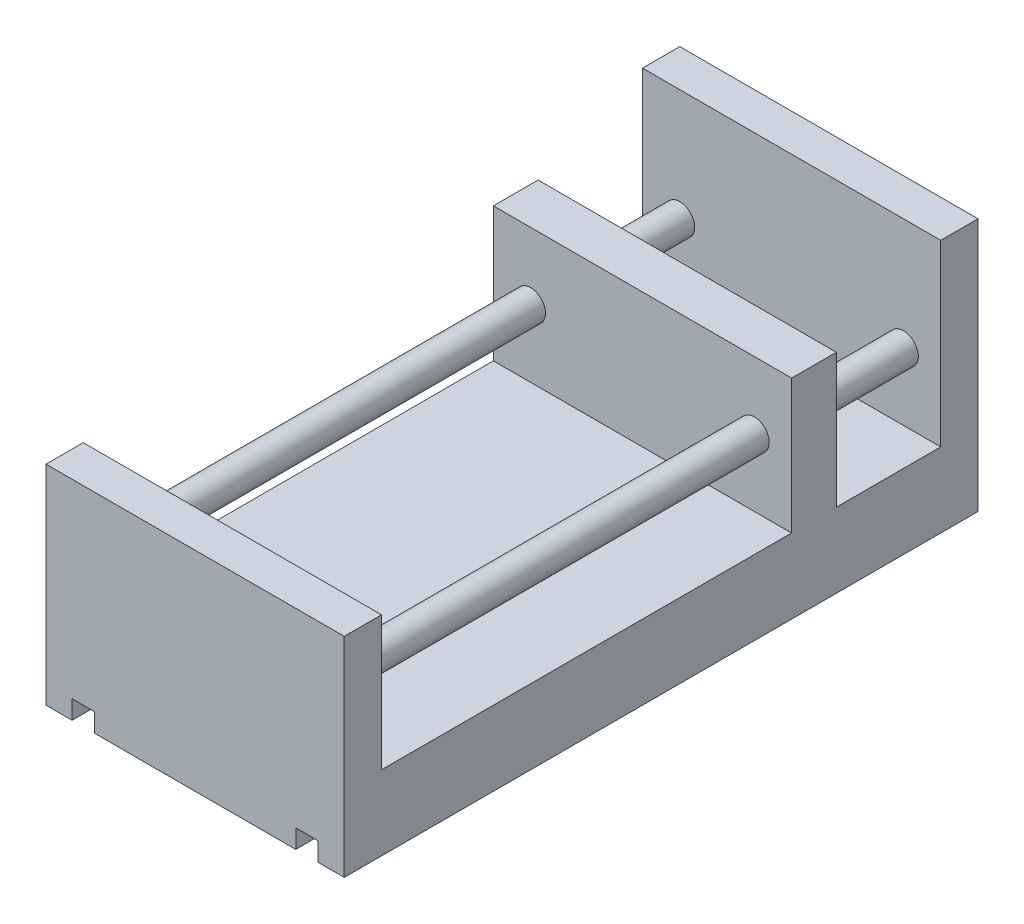
ISO-10303-21;
HEADER;
FILE_DESCRIPTION(('STEP AP214'),'2;1');
FILE_NAME('part.step','',(''),(''),'','','');
FILE_SCHEMA(('AUTOMOTIVE_DESIGN { 1 0 10303 214 1 1 1 1 }'));
ENDSEC;
DATA;
#1=APPLICATION_CONTEXT('core data for automotive mechanical design processes');
#2=APPLICATION_PROTOCOL_DEFINITION('international standard','automotive_design',2000,#1);
#3=PRODUCT_CONTEXT('',#1,'mechanical');
#4=PRODUCT('Part','Part','',(#3));
#5=PRODUCT_RELATED_PRODUCT_CATEGORY('part','',(#4));
#6=PRODUCT_DEFINITION_FORMATION('','',#4);
#7=PRODUCT_DEFINITION_CONTEXT('part definition',#1,'design');
#8=PRODUCT_DEFINITION('design','',#6,#7);
#9=PRODUCT_DEFINITION_SHAPE('','',#8);
#10=(LENGTH_UNIT() NAMED_UNIT(*) SI_UNIT(.MILLI.,.METRE.));
#11=(NAMED_UNIT(*) PLANE_ANGLE_UNIT() SI_UNIT($,.RADIAN.));
#12=(NAMED_UNIT(*) SI_UNIT($,.STERADIAN.) SOLID_ANGLE_UNIT());
#13=UNCERTAINTY_MEASURE_WITH_UNIT(LENGTH_MEASURE(1.E-05),#10,'distance_accuracy_value','');
#14=(GEOMETRIC_REPRESENTATION_CONTEXT(3) GLOBAL_UNCERTAINTY_ASSIGNED_CONTEXT((#13)) GLOBAL_UNIT_ASSIGNED_CONTEXT((#10,
#11,#12)) REPRESENTATION_CONTEXT('',''));
#15=CARTESIAN_POINT('',(0.,0.,0.));
#16=DIRECTION('',(0.,0.,1.));
#17=DIRECTION('',(1.,0.,0.));
#18=AXIS2_PLACEMENT_3D('',#15,#16,#17);
#19=CARTESIAN_POINT('',(0.,0.,0.));
#20=DIRECTION('',(0.,1.,0.));
#21=DIRECTION('',(0.,0.,1.));
#22=AXIS2_PLACEMENT_3D('',#19,#20,#21);
#23=PLANE('',#22);
#24=DIRECTION('',(1.,0.,0.));
#25=VECTOR('',#24,1.);
#26=CARTESIAN_POINT('',(0.,0.,85.));
#27=LINE('',#26,#25);
#28=CARTESIAN_POINT('',(33.,0.,85.));
#29=VERTEX_POINT('',#28);
#30=CARTESIAN_POINT('',(40.,0.,85.));
#31=VERTEX_POINT('',#30);
#32=EDGE_CURVE('E298',#29,#31,#27,.T.);
#33=ORIENTED_EDGE('',*,*,#32,.F.);
#34=DIRECTION('',(0.,0.,1.));
#35=VECTOR('',#34,1.);
#36=CARTESIAN_POINT('',(33.,0.,85.));
#37=LINE('',#36,#35);
#38=CARTESIAN_POINT('',(33.,0.,-85.));
#39=VERTEX_POINT('',#38);
#40=EDGE_CURVE('E185',#39,#29,#37,.T.);
#41=ORIENTED_EDGE('',*,*,#40,.F.);
#42=DIRECTION('',(1.,0.,0.));
#43=VECTOR('',#42,1.);
#44=CARTESIAN_POINT('',(0.,0.,-85.));
#45=LINE('',#44,#43);
#46=CARTESIAN_POINT('',(40.,0.,-85.));
#47=VERTEX_POINT('',#46);
#48=EDGE_CURVE('E232',#39,#47,#45,.T.);
#49=ORIENTED_EDGE('',*,*,#48,.T.);
#50=DIRECTION('',(0.,0.,1.));
#51=VECTOR('',#50,1.);
#52=CARTESIAN_POINT('',(40.,0.,0.));
#53=LINE('',#52,#51);
#54=EDGE_CURVE('E328',#47,#31,#53,.T.);
#55=ORIENTED_EDGE('',*,*,#54,.T.);
#56=EDGE_LOOP('',(#33,#41,#49,#55));
#57=FACE_BOUND('',#56,.T.);
#58=ADVANCED_FACE('F32',(#57),#23,.F.);
#59=CARTESIAN_POINT('',(-27.,0.,-85.));
#60=VERTEX_POINT('',#59);
#61=CARTESIAN_POINT('',(27.,0.,-85.));
#62=VERTEX_POINT('',#61);
#63=EDGE_CURVE('E252',#60,#62,#45,.T.);
#64=ORIENTED_EDGE('',*,*,#63,.T.);
#65=DIRECTION('',(0.,0.,-1.));
#66=VECTOR('',#65,1.);
#67=CARTESIAN_POINT('',(27.,0.,85.));
#68=LINE('',#67,#66);
#69=CARTESIAN_POINT('',(27.,0.,85.));
#70=VERTEX_POINT('',#69);
#71=EDGE_CURVE('E393',#70,#62,#68,.T.);
#72=ORIENTED_EDGE('',*,*,#71,.F.);
#73=CARTESIAN_POINT('',(-27.,0.,85.));
#74=VERTEX_POINT('',#73);
#75=EDGE_CURVE('E191',#74,#70,#27,.T.);
#76=ORIENTED_EDGE('',*,*,#75,.F.);
#77=DIRECTION('',(0.,0.,1.));
#78=VECTOR('',#77,1.);
#79=CARTESIAN_POINT('',(-27.,0.,85.));
#80=LINE('',#79,#78);
#81=EDGE_CURVE('E200',#60,#74,#80,.T.);
#82=ORIENTED_EDGE('',*,*,#81,.F.);
#83=EDGE_LOOP('',(#64,#72,#76,#82));
#84=FACE_BOUND('',#83,.T.);
#85=ADVANCED_FACE('F392',(#84),#23,.F.);
#86=CARTESIAN_POINT('',(-40.,20.,0.));
#87=DIRECTION('',(1.,0.,0.));
#88=DIRECTION('',(0.,0.,-1.));
#89=AXIS2_PLACEMENT_3D('',#86,#87,#88);
#90=PLANE('',#89);
#91=DIRECTION('',(0.,0.,1.));
#92=VECTOR('',#91,1.);
#93=CARTESIAN_POINT('',(-40.,0.,0.));
#94=LINE('',#93,#92);
#95=CARTESIAN_POINT('',(-40.,0.,-85.));
#96=VERTEX_POINT('',#95);
#97=CARTESIAN_POINT('',(-40.,0.,85.));
#98=VERTEX_POINT('',#97);
#99=EDGE_CURVE('E323',#96,#98,#94,.T.);
#100=ORIENTED_EDGE('',*,*,#99,.T.);
#101=DIRECTION('',(0.,-1.,0.));
#102=VECTOR('',#101,1.);
#103=CARTESIAN_POINT('',(-40.,56.,85.));
#104=LINE('',#103,#102);
#105=CARTESIAN_POINT('',(-40.,56.,85.));
#106=VERTEX_POINT('',#105);
#107=EDGE_CURVE('E317',#106,#98,#104,.T.);
#108=ORIENTED_EDGE('',*,*,#107,.F.);
#109=DIRECTION('',(0.,0.,1.));
#110=VECTOR('',#109,1.);
#111=CARTESIAN_POINT('',(-40.,56.,0.));
#112=LINE('',#111,#110);
#113=CARTESIAN_POINT('',(-40.,56.,75.));
#114=VERTEX_POINT('',#113);
#115=EDGE_CURVE('E302',#114,#106,#112,.T.);
#116=ORIENTED_EDGE('',*,*,#115,.F.);
#117=DIRECTION('',(0.,-1.,0.));
#118=VECTOR('',#117,1.);
#119=CARTESIAN_POINT('',(-40.,56.,75.));
#120=LINE('',#119,#118);
#121=CARTESIAN_POINT('',(-40.,20.,75.));
#122=VERTEX_POINT('',#121);
#123=EDGE_CURVE('E320',#114,#122,#120,.T.);
#124=ORIENTED_EDGE('',*,*,#123,.T.);
#125=DIRECTION('',(0.,0.,1.));
#126=VECTOR('',#125,1.);
#127=CARTESIAN_POINT('',(-40.,20.,0.));
#128=LINE('',#127,#126);
#129=CARTESIAN_POINT('',(-40.,20.,-35.));
#130=VERTEX_POINT('',#129);
#131=EDGE_CURVE('E327',#130,#122,#128,.T.);
#132=ORIENTED_EDGE('',*,*,#131,.F.);
#133=DIRECTION('',(0.,-1.,0.));
#134=VECTOR('',#133,1.);
#135=CARTESIAN_POINT('',(-40.,56.,-35.));
#136=LINE('',#135,#134);
#137=CARTESIAN_POINT('',(-40.,56.,-35.));
#138=VERTEX_POINT('',#137);
#139=EDGE_CURVE('E295',#138,#130,#136,.T.);
#140=ORIENTED_EDGE('',*,*,#139,.F.);
#141=DIRECTION('',(0.,0.,1.));
#142=VECTOR('',#141,1.);
#143=CARTESIAN_POINT('',(-40.,56.,0.));
#144=LINE('',#143,#142);
#145=CARTESIAN_POINT('',(-40.,56.,-47.));
#146=VERTEX_POINT('',#145);
#147=EDGE_CURVE('E276',#146,#138,#144,.T.);
#148=ORIENTED_EDGE('',*,*,#147,.F.);
#149=DIRECTION('',(0.,-1.,0.));
#150=VECTOR('',#149,1.);
#151=CARTESIAN_POINT('',(-40.,56.,-47.));
#152=LINE('',#151,#150);
#153=CARTESIAN_POINT('',(-40.,20.,-47.));
#154=VERTEX_POINT('',#153);
#155=EDGE_CURVE('E287',#146,#154,#152,.T.);
#156=ORIENTED_EDGE('',*,*,#155,.T.);
#157=DIRECTION('',(0.,0.,1.));
#158=VECTOR('',#157,1.);
#159=CARTESIAN_POINT('',(-40.,20.,0.));
#160=LINE('',#159,#158);
#161=CARTESIAN_POINT('',(-40.,20.,-75.));
#162=VERTEX_POINT('',#161);
#163=EDGE_CURVE('E264',#162,#154,#160,.T.);
#164=ORIENTED_EDGE('',*,*,#163,.F.);
#165=DIRECTION('',(0.,-1.,0.));
#166=VECTOR('',#165,1.);
#167=CARTESIAN_POINT('',(-40.,68.,-75.));
#168=LINE('',#167,#166);
#169=CARTESIAN_POINT('',(-40.,68.,-75.));
#170=VERTEX_POINT('',#169);
#171=EDGE_CURVE('E261',#170,#162,#168,.T.);
#172=ORIENTED_EDGE('',*,*,#171,.F.);
#173=DIRECTION('',(0.,0.,1.));
#174=VECTOR('',#173,1.);
#175=CARTESIAN_POINT('',(-40.,68.,0.));
#176=LINE('',#175,#174);
#177=CARTESIAN_POINT('',(-40.,68.,-85.));
#178=VERTEX_POINT('',#177);
#179=EDGE_CURVE('E237',#178,#170,#176,.T.);
#180=ORIENTED_EDGE('',*,*,#179,.F.);
#181=DIRECTION('',(0.,-1.,0.));
#182=VECTOR('',#181,1.);
#183=CARTESIAN_POINT('',(-40.,68.,-85.));
#184=LINE('',#183,#182);
#185=EDGE_CURVE('E249',#178,#96,#184,.T.);
#186=ORIENTED_EDGE('',*,*,#185,.T.);
#187=EDGE_LOOP('',(#100,#108,#116,#124,#132,#140,#148,#156,#164,#172,#180,#186));
#188=FACE_BOUND('',#187,.T.);
#189=ADVANCED_FACE('F34',(#188),#90,.F.);
#190=CARTESIAN_POINT('',(40.,20.,0.));
#191=DIRECTION('',(1.,0.,0.));
#192=DIRECTION('',(0.,0.,-1.));
#193=AXIS2_PLACEMENT_3D('',#190,#191,#192);
#194=PLANE('',#193);
#195=ORIENTED_EDGE('',*,*,#54,.F.);
#196=DIRECTION('',(0.,-1.,0.));
#197=VECTOR('',#196,1.);
#198=CARTESIAN_POINT('',(40.,68.,-85.));
#199=LINE('',#198,#197);
#200=CARTESIAN_POINT('',(40.,68.,-85.));
#201=VERTEX_POINT('',#200);
#202=EDGE_CURVE('E255',#201,#47,#199,.T.);
#203=ORIENTED_EDGE('',*,*,#202,.F.);
#204=DIRECTION('',(0.,0.,1.));
#205=VECTOR('',#204,1.);
#206=CARTESIAN_POINT('',(40.,68.,0.));
#207=LINE('',#206,#205);
#208=CARTESIAN_POINT('',(40.,68.,-75.));
#209=VERTEX_POINT('',#208);
#210=EDGE_CURVE('E243',#201,#209,#207,.T.);
#211=ORIENTED_EDGE('',*,*,#210,.T.);
#212=DIRECTION('',(0.,-1.,0.));
#213=VECTOR('',#212,1.);
#214=CARTESIAN_POINT('',(40.,68.,-75.));
#215=LINE('',#214,#213);
#216=CARTESIAN_POINT('',(40.,20.,-75.));
#217=VERTEX_POINT('',#216);
#218=EDGE_CURVE('E258',#209,#217,#215,.T.);
#219=ORIENTED_EDGE('',*,*,#218,.T.);
#220=DIRECTION('',(0.,0.,1.));
#221=VECTOR('',#220,1.);
#222=CARTESIAN_POINT('',(40.,20.,0.));
#223=LINE('',#222,#221);
#224=CARTESIAN_POINT('',(40.,20.,-47.));
#225=VERTEX_POINT('',#224);
#226=EDGE_CURVE('E270',#217,#225,#223,.T.);
#227=ORIENTED_EDGE('',*,*,#226,.T.);
#228=DIRECTION('',(0.,-1.,0.));
#229=VECTOR('',#228,1.);
#230=CARTESIAN_POINT('',(40.,56.,-47.));
#231=LINE('',#230,#229);
#232=CARTESIAN_POINT('',(40.,56.,-47.));
#233=VERTEX_POINT('',#232);
#234=EDGE_CURVE('E290',#233,#225,#231,.T.);
#235=ORIENTED_EDGE('',*,*,#234,.F.);
#236=DIRECTION('',(0.,0.,1.));
#237=VECTOR('',#236,1.);
#238=CARTESIAN_POINT('',(40.,56.,0.));
#239=LINE('',#238,#237);
#240=CARTESIAN_POINT('',(40.,56.,-35.));
#241=VERTEX_POINT('',#240);
#242=EDGE_CURVE('E281',#233,#241,#239,.T.);
#243=ORIENTED_EDGE('',*,*,#242,.T.);
#244=DIRECTION('',(0.,-1.,0.));
#245=VECTOR('',#244,1.);
#246=CARTESIAN_POINT('',(40.,56.,-35.));
#247=LINE('',#246,#245);
#248=CARTESIAN_POINT('',(40.,20.,-35.));
#249=VERTEX_POINT('',#248);
#250=EDGE_CURVE('E292',#241,#249,#247,.T.);
#251=ORIENTED_EDGE('',*,*,#250,.T.);
#252=DIRECTION('',(0.,0.,1.));
#253=VECTOR('',#252,1.);
#254=CARTESIAN_POINT('',(40.,20.,0.));
#255=LINE('',#254,#253);
#256=CARTESIAN_POINT('',(40.,20.,75.));
#257=VERTEX_POINT('',#256);
#258=EDGE_CURVE('E334',#249,#257,#255,.T.);
#259=ORIENTED_EDGE('',*,*,#258,.T.);
#260=DIRECTION('',(0.,-1.,0.));
#261=VECTOR('',#260,1.);
#262=CARTESIAN_POINT('',(40.,56.,75.));
#263=LINE('',#262,#261);
#264=CARTESIAN_POINT('',(40.,56.,75.));
#265=VERTEX_POINT('',#264);
#266=EDGE_CURVE('E310',#265,#257,#263,.T.);
#267=ORIENTED_EDGE('',*,*,#266,.F.);
#268=DIRECTION('',(0.,0.,1.));
#269=VECTOR('',#268,1.);
#270=CARTESIAN_POINT('',(40.,56.,0.));
#271=LINE('',#270,#269);
#272=CARTESIAN_POINT('',(40.,56.,85.));
#273=VERTEX_POINT('',#272);
#274=EDGE_CURVE('E307',#265,#273,#271,.T.);
#275=ORIENTED_EDGE('',*,*,#274,.T.);
#276=DIRECTION('',(0.,-1.,0.));
#277=VECTOR('',#276,1.);
#278=CARTESIAN_POINT('',(40.,56.,85.));
#279=LINE('',#278,#277);
#280=EDGE_CURVE('E314',#273,#31,#279,.T.);
#281=ORIENTED_EDGE('',*,*,#280,.T.);
#282=EDGE_LOOP('',(#195,#203,#211,#219,#227,#235,#243,#251,#259,#267,#275,#281));
#283=FACE_BOUND('',#282,.T.);
#284=ADVANCED_FACE('F361',(#283),#194,.T.);
#285=CARTESIAN_POINT('',(0.,20.,0.));
#286=DIRECTION('',(0.,1.,0.));
#287=DIRECTION('',(0.,0.,1.));
#288=AXIS2_PLACEMENT_3D('',#285,#286,#287);
#289=PLANE('',#288);
#290=DIRECTION('',(1.,0.,0.));
#291=VECTOR('',#290,1.);
#292=CARTESIAN_POINT('',(0.,20.,-35.));
#293=LINE('',#292,#291);
#294=EDGE_CURVE('E324',#130,#249,#293,.T.);
#295=ORIENTED_EDGE('',*,*,#294,.F.);
#296=ORIENTED_EDGE('',*,*,#131,.T.);
#297=DIRECTION('',(1.,0.,0.));
#298=VECTOR('',#297,1.);
#299=CARTESIAN_POINT('',(0.,20.,75.));
#300=LINE('',#299,#298);
#301=EDGE_CURVE('E331',#122,#257,#300,.T.);
#302=ORIENTED_EDGE('',*,*,#301,.T.);
#303=ORIENTED_EDGE('',*,*,#258,.F.);
#304=EDGE_LOOP('',(#295,#296,#302,#303));
#305=FACE_BOUND('',#304,.T.);
#306=ADVANCED_FACE('F405',(#305),#289,.T.);
#307=CARTESIAN_POINT('',(-33.,0.,-85.));
#308=VERTEX_POINT('',#307);
#309=EDGE_CURVE('E241',#96,#308,#45,.T.);
#310=ORIENTED_EDGE('',*,*,#309,.T.);
#311=DIRECTION('',(0.,0.,-1.));
#312=VECTOR('',#311,1.);
#313=CARTESIAN_POINT('',(-33.,0.,85.));
#314=LINE('',#313,#312);
#315=CARTESIAN_POINT('',(-33.,0.,85.));
#316=VERTEX_POINT('',#315);
#317=EDGE_CURVE('E208',#316,#308,#314,.T.);
#318=ORIENTED_EDGE('',*,*,#317,.F.);
#319=EDGE_CURVE('E303',#98,#316,#27,.T.);
#320=ORIENTED_EDGE('',*,*,#319,.F.);
#321=ORIENTED_EDGE('',*,*,#99,.F.);
#322=EDGE_LOOP('',(#310,#318,#320,#321));
#323=FACE_BOUND('',#322,.T.);
#324=ADVANCED_FACE('F378',(#323),#23,.F.);
#325=CARTESIAN_POINT('',(0.,56.,75.));
#326=DIRECTION('',(0.,0.,-1.));
#327=DIRECTION('',(-1.,0.,0.));
#328=AXIS2_PLACEMENT_3D('',#325,#326,#327);
#329=PLANE('',#328);
#330=CARTESIAN_POINT('',(-30.,38.,75.));
#331=DIRECTION('',(0.,0.,-1.));
#332=DIRECTION('',(-1.,0.,0.));
#333=AXIS2_PLACEMENT_3D('',#330,#331,#332);
#334=CIRCLE('',#333,4.00000000000001);
#335=CARTESIAN_POINT('',(-34.,38.,75.));
#336=VERTEX_POINT('',#335);
#337=EDGE_CURVE('E214',#336,#336,#334,.T.);
#338=ORIENTED_EDGE('',*,*,#337,.F.);
#339=EDGE_LOOP('',(#338));
#340=FACE_BOUND('',#339,.T.);
#341=CARTESIAN_POINT('',(30.,38.,75.));
#342=DIRECTION('',(0.,0.,-1.));
#343=DIRECTION('',(-1.,0.,0.));
#344=AXIS2_PLACEMENT_3D('',#341,#342,#343);
#345=CIRCLE('',#344,4.);
#346=CARTESIAN_POINT('',(26.,38.,75.));
#347=VERTEX_POINT('',#346);
#348=EDGE_CURVE('E225',#347,#347,#345,.T.);
#349=ORIENTED_EDGE('',*,*,#348,.F.);
#350=EDGE_LOOP('',(#349));
#351=FACE_BOUND('',#350,.T.);
#352=ORIENTED_EDGE('',*,*,#301,.F.);
#353=ORIENTED_EDGE('',*,*,#123,.F.);
#354=DIRECTION('',(1.,0.,0.));
#355=VECTOR('',#354,1.);
#356=CARTESIAN_POINT('',(0.,56.,75.));
#357=LINE('',#356,#355);
#358=EDGE_CURVE('E299',#114,#265,#357,.T.);
#359=ORIENTED_EDGE('',*,*,#358,.T.);
#360=ORIENTED_EDGE('',*,*,#266,.T.);
#361=EDGE_LOOP('',(#352,#353,#359,#360));
#362=FACE_BOUND('',#361,.T.);
#363=ADVANCED_FACE('F432',(#340,#351,#362),#329,.T.);
#364=CARTESIAN_POINT('',(0.,56.,85.));
#365=DIRECTION('',(0.,0.,-1.));
#366=DIRECTION('',(-1.,0.,0.));
#367=AXIS2_PLACEMENT_3D('',#364,#365,#366);
#368=PLANE('',#367);
#369=DIRECTION('',(-1.,0.,0.));
#370=VECTOR('',#369,1.);
#371=CARTESIAN_POINT('',(27.,5.,85.));
#372=LINE('',#371,#370);
#373=CARTESIAN_POINT('',(33.,5.,85.));
#374=VERTEX_POINT('',#373);
#375=CARTESIAN_POINT('',(27.,5.,85.));
#376=VERTEX_POINT('',#375);
#377=EDGE_CURVE('E176',#374,#376,#372,.T.);
#378=ORIENTED_EDGE('',*,*,#377,.F.);
#379=DIRECTION('',(0.,-1.,0.));
#380=VECTOR('',#379,1.);
#381=CARTESIAN_POINT('',(33.,5.,85.));
#382=LINE('',#381,#380);
#383=EDGE_CURVE('E210',#374,#29,#382,.T.);
#384=ORIENTED_EDGE('',*,*,#383,.T.);
#385=ORIENTED_EDGE('',*,*,#32,.T.);
#386=ORIENTED_EDGE('',*,*,#280,.F.);
#387=DIRECTION('',(1.,0.,0.));
#388=VECTOR('',#387,1.);
#389=CARTESIAN_POINT('',(0.,56.,85.));
#390=LINE('',#389,#388);
#391=EDGE_CURVE('E305',#106,#273,#390,.T.);
#392=ORIENTED_EDGE('',*,*,#391,.F.);
#393=ORIENTED_EDGE('',*,*,#107,.T.);
#394=ORIENTED_EDGE('',*,*,#319,.T.);
#395=DIRECTION('',(0.,-1.,0.));
#396=VECTOR('',#395,1.);
#397=CARTESIAN_POINT('',(-33.,5.,85.));
#398=LINE('',#397,#396);
#399=CARTESIAN_POINT('',(-33.,5.,85.));
#400=VERTEX_POINT('',#399);
#401=EDGE_CURVE('E207',#400,#316,#398,.T.);
#402=ORIENTED_EDGE('',*,*,#401,.F.);
#403=DIRECTION('',(-1.,0.,0.));
#404=VECTOR('',#403,1.);
#405=CARTESIAN_POINT('',(-33.,5.,85.));
#406=LINE('',#405,#404);
#407=CARTESIAN_POINT('',(-27.,5.,85.));
#408=VERTEX_POINT('',#407);
#409=EDGE_CURVE('E198',#408,#400,#406,.T.);
#410=ORIENTED_EDGE('',*,*,#409,.F.);
#411=DIRECTION('',(0.,-1.,0.));
#412=VECTOR('',#411,1.);
#413=CARTESIAN_POINT('',(-27.,5.,85.));
#414=LINE('',#413,#412);
#415=EDGE_CURVE('E212',#408,#74,#414,.T.);
#416=ORIENTED_EDGE('',*,*,#415,.T.);
#417=ORIENTED_EDGE('',*,*,#75,.T.);
#418=DIRECTION('',(0.,-1.,0.));
#419=VECTOR('',#418,1.);
#420=CARTESIAN_POINT('',(27.,5.,85.));
#421=LINE('',#420,#419);
#422=EDGE_CURVE('E170',#376,#70,#421,.T.);
#423=ORIENTED_EDGE('',*,*,#422,.F.);
#424=EDGE_LOOP('',(#378,#384,#385,#386,#392,#393,#394,#402,#410,#416,#417,#423));
#425=FACE_BOUND('',#424,.T.);
#426=ADVANCED_FACE('F188',(#425),#368,.F.);
#427=CARTESIAN_POINT('',(0.,56.,0.));
#428=DIRECTION('',(0.,1.,0.));
#429=DIRECTION('',(0.,0.,1.));
#430=AXIS2_PLACEMENT_3D('',#427,#428,#429);
#431=PLANE('',#430);
#432=ORIENTED_EDGE('',*,*,#358,.F.);
#433=ORIENTED_EDGE('',*,*,#115,.T.);
#434=ORIENTED_EDGE('',*,*,#391,.T.);
#435=ORIENTED_EDGE('',*,*,#274,.F.);
#436=EDGE_LOOP('',(#432,#433,#434,#435));
#437=FACE_BOUND('',#436,.T.);
#438=ADVANCED_FACE('F400',(#437),#431,.T.);
#439=CARTESIAN_POINT('',(0.,56.,-35.));
#440=DIRECTION('',(0.,0.,-1.));
#441=DIRECTION('',(-1.,0.,0.));
#442=AXIS2_PLACEMENT_3D('',#439,#440,#441);
#443=PLANE('',#442);
#444=CARTESIAN_POINT('',(-30.,38.,-35.));
#445=DIRECTION('',(0.,0.,-1.));
#446=DIRECTION('',(-1.,0.,0.));
#447=AXIS2_PLACEMENT_3D('',#444,#445,#446);
#448=CIRCLE('',#447,4.00000000000001);
#449=CARTESIAN_POINT('',(-34.,38.,-35.));
#450=VERTEX_POINT('',#449);
#451=EDGE_CURVE('E11',#450,#450,#448,.F.);
#452=ORIENTED_EDGE('',*,*,#451,.F.);
#453=EDGE_LOOP('',(#452));
#454=FACE_BOUND('',#453,.T.);
#455=CARTESIAN_POINT('',(30.,38.,-35.));
#456=DIRECTION('',(0.,0.,-1.));
#457=DIRECTION('',(-1.,0.,0.));
#458=AXIS2_PLACEMENT_3D('',#455,#456,#457);
#459=CIRCLE('',#458,4.);
#460=CARTESIAN_POINT('',(26.,38.,-35.));
#461=VERTEX_POINT('',#460);
#462=EDGE_CURVE('E233',#461,#461,#459,.F.);
#463=ORIENTED_EDGE('',*,*,#462,.F.);
#464=EDGE_LOOP('',(#463));
#465=FACE_BOUND('',#464,.T.);
#466=ORIENTED_EDGE('',*,*,#139,.T.);
#467=ORIENTED_EDGE('',*,*,#294,.T.);
#468=ORIENTED_EDGE('',*,*,#250,.F.);
#469=DIRECTION('',(1.,0.,0.));
#470=VECTOR('',#469,1.);
#471=CARTESIAN_POINT('',(0.,56.,-35.));
#472=LINE('',#471,#470);
#473=EDGE_CURVE('E279',#138,#241,#472,.T.);
#474=ORIENTED_EDGE('',*,*,#473,.F.);
#475=EDGE_LOOP('',(#466,#467,#468,#474));
#476=FACE_BOUND('',#475,.T.);
#477=ADVANCED_FACE('F408',(#454,#465,#476),#443,.F.);
#478=CARTESIAN_POINT('',(0.,56.,-47.));
#479=DIRECTION('',(0.,0.,-1.));
#480=DIRECTION('',(-1.,0.,0.));
#481=AXIS2_PLACEMENT_3D('',#478,#479,#480);
#482=PLANE('',#481);
#483=CARTESIAN_POINT('',(-30.,38.,-47.));
#484=DIRECTION('',(0.,0.,-1.));
#485=DIRECTION('',(-1.,0.,0.));
#486=AXIS2_PLACEMENT_3D('',#483,#484,#485);
#487=CIRCLE('',#486,4.00000000000001);
#488=CARTESIAN_POINT('',(-34.,38.,-47.));
#489=VERTEX_POINT('',#488);
#490=EDGE_CURVE('E223',#489,#489,#487,.F.);
#491=ORIENTED_EDGE('',*,*,#490,.T.);
#492=EDGE_LOOP('',(#491));
#493=FACE_BOUND('',#492,.T.);
#494=CARTESIAN_POINT('',(30.,38.,-47.));
#495=DIRECTION('',(0.,0.,-1.));
#496=DIRECTION('',(-1.,0.,0.));
#497=AXIS2_PLACEMENT_3D('',#494,#495,#496);
#498=CIRCLE('',#497,4.);
#499=CARTESIAN_POINT('',(26.,38.,-47.));
#500=VERTEX_POINT('',#499);
#501=EDGE_CURVE('E229',#500,#500,#498,.F.);
#502=ORIENTED_EDGE('',*,*,#501,.T.);
#503=EDGE_LOOP('',(#502));
#504=FACE_BOUND('',#503,.T.);
#505=DIRECTION('',(1.,0.,0.));
#506=VECTOR('',#505,1.);
#507=CARTESIAN_POINT('',(0.,20.,-47.));
#508=LINE('',#507,#506);
#509=EDGE_CURVE('E267',#154,#225,#508,.T.);
#510=ORIENTED_EDGE('',*,*,#509,.F.);
#511=ORIENTED_EDGE('',*,*,#155,.F.);
#512=DIRECTION('',(1.,0.,0.));
#513=VECTOR('',#512,1.);
#514=CARTESIAN_POINT('',(0.,56.,-47.));
#515=LINE('',#514,#513);
#516=EDGE_CURVE('E284',#146,#233,#515,.T.);
#517=ORIENTED_EDGE('',*,*,#516,.T.);
#518=ORIENTED_EDGE('',*,*,#234,.T.);
#519=EDGE_LOOP('',(#510,#511,#517,#518));
#520=FACE_BOUND('',#519,.T.);
#521=ADVANCED_FACE('F413',(#493,#504,#520),#482,.T.);
#522=CARTESIAN_POINT('',(0.,56.,0.));
#523=DIRECTION('',(0.,1.,0.));
#524=DIRECTION('',(0.,0.,1.));
#525=AXIS2_PLACEMENT_3D('',#522,#523,#524);
#526=PLANE('',#525);
#527=ORIENTED_EDGE('',*,*,#147,.T.);
#528=ORIENTED_EDGE('',*,*,#473,.T.);
#529=ORIENTED_EDGE('',*,*,#242,.F.);
#530=ORIENTED_EDGE('',*,*,#516,.F.);
#531=EDGE_LOOP('',(#527,#528,#529,#530));
#532=FACE_BOUND('',#531,.T.);
#533=ADVANCED_FACE('F411',(#532),#526,.T.);
#534=CARTESIAN_POINT('',(0.,20.,0.));
#535=DIRECTION('',(0.,1.,0.));
#536=DIRECTION('',(0.,0.,1.));
#537=AXIS2_PLACEMENT_3D('',#534,#535,#536);
#538=PLANE('',#537);
#539=ORIENTED_EDGE('',*,*,#163,.T.);
#540=ORIENTED_EDGE('',*,*,#509,.T.);
#541=ORIENTED_EDGE('',*,*,#226,.F.);
#542=DIRECTION('',(1.,0.,0.));
#543=VECTOR('',#542,1.);
#544=CARTESIAN_POINT('',(0.,20.,-75.));
#545=LINE('',#544,#543);
#546=EDGE_CURVE('E273',#162,#217,#545,.T.);
#547=ORIENTED_EDGE('',*,*,#546,.F.);
#548=EDGE_LOOP('',(#539,#540,#541,#547));
#549=FACE_BOUND('',#548,.T.);
#550=ADVANCED_FACE('F348',(#549),#538,.T.);
#551=CARTESIAN_POINT('',(0.,68.,-75.));
#552=DIRECTION('',(0.,0.,-1.));
#553=DIRECTION('',(-1.,0.,0.));
#554=AXIS2_PLACEMENT_3D('',#551,#552,#553);
#555=PLANE('',#554);
#556=CARTESIAN_POINT('',(-30.,38.,-75.));
#557=DIRECTION('',(0.,0.,-1.));
#558=DIRECTION('',(-1.,0.,0.));
#559=AXIS2_PLACEMENT_3D('',#556,#557,#558);
#560=CIRCLE('',#559,4.00000000000001);
#561=CARTESIAN_POINT('',(-34.,38.,-75.));
#562=VERTEX_POINT('',#561);
#563=EDGE_CURVE('E36',#562,#562,#560,.F.);
#564=ORIENTED_EDGE('',*,*,#563,.F.);
#565=EDGE_LOOP('',(#564));
#566=FACE_BOUND('',#565,.T.);
#567=CARTESIAN_POINT('',(30.,38.,-75.));
#568=DIRECTION('',(0.,0.,-1.));
#569=DIRECTION('',(-1.,0.,0.));
#570=AXIS2_PLACEMENT_3D('',#567,#568,#569);
#571=CIRCLE('',#570,4.);
#572=CARTESIAN_POINT('',(26.,38.,-75.));
#573=VERTEX_POINT('',#572);
#574=EDGE_CURVE('E236',#573,#573,#571,.F.);
#575=ORIENTED_EDGE('',*,*,#574,.F.);
#576=EDGE_LOOP('',(#575));
#577=FACE_BOUND('',#576,.T.);
#578=ORIENTED_EDGE('',*,*,#171,.T.);
#579=ORIENTED_EDGE('',*,*,#546,.T.);
#580=ORIENTED_EDGE('',*,*,#218,.F.);
#581=DIRECTION('',(1.,0.,0.));
#582=VECTOR('',#581,1.);
#583=CARTESIAN_POINT('',(0.,68.,-75.));
#584=LINE('',#583,#582);
#585=EDGE_CURVE('E240',#170,#209,#584,.T.);
#586=ORIENTED_EDGE('',*,*,#585,.F.);
#587=EDGE_LOOP('',(#578,#579,#580,#586));
#588=FACE_BOUND('',#587,.T.);
#589=ADVANCED_FACE('F344',(#566,#577,#588),#555,.F.);
#590=CARTESIAN_POINT('',(0.,68.,-85.));
#591=DIRECTION('',(0.,0.,-1.));
#592=DIRECTION('',(-1.,0.,0.));
#593=AXIS2_PLACEMENT_3D('',#590,#591,#592);
#594=PLANE('',#593);
#595=DIRECTION('',(0.,-1.,0.));
#596=VECTOR('',#595,1.);
#597=CARTESIAN_POINT('',(33.,5.,-85.));
#598=LINE('',#597,#596);
#599=CARTESIAN_POINT('',(33.,5.,-85.));
#600=VERTEX_POINT('',#599);
#601=EDGE_CURVE('E193',#600,#39,#598,.T.);
#602=ORIENTED_EDGE('',*,*,#601,.F.);
#603=DIRECTION('',(1.,0.,0.));
#604=VECTOR('',#603,1.);
#605=CARTESIAN_POINT('',(33.,5.,-85.));
#606=LINE('',#605,#604);
#607=CARTESIAN_POINT('',(27.,5.,-85.));
#608=VERTEX_POINT('',#607);
#609=EDGE_CURVE('E175',#608,#600,#606,.T.);
#610=ORIENTED_EDGE('',*,*,#609,.F.);
#611=DIRECTION('',(0.,-1.,0.));
#612=VECTOR('',#611,1.);
#613=CARTESIAN_POINT('',(27.,5.,-85.));
#614=LINE('',#613,#612);
#615=EDGE_CURVE('E173',#608,#62,#614,.T.);
#616=ORIENTED_EDGE('',*,*,#615,.T.);
#617=ORIENTED_EDGE('',*,*,#63,.F.);
#618=DIRECTION('',(0.,-1.,0.));
#619=VECTOR('',#618,1.);
#620=CARTESIAN_POINT('',(-27.,5.,-85.));
#621=LINE('',#620,#619);
#622=CARTESIAN_POINT('',(-27.,5.,-85.));
#623=VERTEX_POINT('',#622);
#624=EDGE_CURVE('E215',#623,#60,#621,.T.);
#625=ORIENTED_EDGE('',*,*,#624,.F.);
#626=DIRECTION('',(1.,0.,0.));
#627=VECTOR('',#626,1.);
#628=CARTESIAN_POINT('',(-27.,5.,-85.));
#629=LINE('',#628,#627);
#630=CARTESIAN_POINT('',(-33.,5.,-85.));
#631=VERTEX_POINT('',#630);
#632=EDGE_CURVE('E202',#631,#623,#629,.T.);
#633=ORIENTED_EDGE('',*,*,#632,.F.);
#634=DIRECTION('',(0.,-1.,0.));
#635=VECTOR('',#634,1.);
#636=CARTESIAN_POINT('',(-33.,5.,-85.));
#637=LINE('',#636,#635);
#638=EDGE_CURVE('E217',#631,#308,#637,.T.);
#639=ORIENTED_EDGE('',*,*,#638,.T.);
#640=ORIENTED_EDGE('',*,*,#309,.F.);
#641=ORIENTED_EDGE('',*,*,#185,.F.);
#642=DIRECTION('',(1.,0.,0.));
#643=VECTOR('',#642,1.);
#644=CARTESIAN_POINT('',(0.,68.,-85.));
#645=LINE('',#644,#643);
#646=EDGE_CURVE('E246',#178,#201,#645,.T.);
#647=ORIENTED_EDGE('',*,*,#646,.T.);
#648=ORIENTED_EDGE('',*,*,#202,.T.);
#649=ORIENTED_EDGE('',*,*,#48,.F.);
#650=EDGE_LOOP('',(#602,#610,#616,#617,#625,#633,#639,#640,#641,#647,#648,#649));
#651=FACE_BOUND('',#650,.T.);
#652=ADVANCED_FACE('F347',(#651),#594,.T.);
#653=CARTESIAN_POINT('',(0.,68.,0.));
#654=DIRECTION('',(0.,1.,0.));
#655=DIRECTION('',(0.,0.,1.));
#656=AXIS2_PLACEMENT_3D('',#653,#654,#655);
#657=PLANE('',#656);
#658=ORIENTED_EDGE('',*,*,#179,.T.);
#659=ORIENTED_EDGE('',*,*,#585,.T.);
#660=ORIENTED_EDGE('',*,*,#210,.F.);
#661=ORIENTED_EDGE('',*,*,#646,.F.);
#662=EDGE_LOOP('',(#658,#659,#660,#661));
#663=FACE_BOUND('',#662,.T.);
#664=ADVANCED_FACE('F365',(#663),#657,.T.);
#665=CARTESIAN_POINT('',(30.,38.,-75.));
#666=DIRECTION('',(0.,0.,1.));
#667=DIRECTION('',(1.,0.,0.));
#668=AXIS2_PLACEMENT_3D('',#665,#666,#667);
#669=CYLINDRICAL_SURFACE('',#668,4.);
#670=ORIENTED_EDGE('',*,*,#501,.F.);
#671=EDGE_LOOP('',(#670));
#672=FACE_BOUND('',#671,.T.);
#673=ORIENTED_EDGE('',*,*,#574,.T.);
#674=EDGE_LOOP('',(#673));
#675=FACE_BOUND('',#674,.T.);
#676=ADVANCED_FACE('F342',(#672,#675),#669,.T.);
#677=ORIENTED_EDGE('',*,*,#348,.T.);
#678=EDGE_LOOP('',(#677));
#679=FACE_BOUND('',#678,.T.);
#680=ORIENTED_EDGE('',*,*,#462,.T.);
#681=EDGE_LOOP('',(#680));
#682=FACE_BOUND('',#681,.T.);
#683=ADVANCED_FACE('F483',(#679,#682),#669,.T.);
#684=CARTESIAN_POINT('',(-30.,38.,-75.));
#685=DIRECTION('',(0.,0.,1.));
#686=DIRECTION('',(1.,0.,0.));
#687=AXIS2_PLACEMENT_3D('',#684,#685,#686);
#688=CYLINDRICAL_SURFACE('',#687,4.00000000000001);
#689=ORIENTED_EDGE('',*,*,#490,.F.);
#690=EDGE_LOOP('',(#689));
#691=FACE_BOUND('',#690,.T.);
#692=ORIENTED_EDGE('',*,*,#563,.T.);
#693=EDGE_LOOP('',(#692));
#694=FACE_BOUND('',#693,.T.);
#695=ADVANCED_FACE('F495',(#691,#694),#688,.T.);
#696=ORIENTED_EDGE('',*,*,#337,.T.);
#697=EDGE_LOOP('',(#696));
#698=FACE_BOUND('',#697,.T.);
#699=ORIENTED_EDGE('',*,*,#451,.T.);
#700=EDGE_LOOP('',(#699));
#701=FACE_BOUND('',#700,.T.);
#702=ADVANCED_FACE('F504',(#698,#701),#688,.T.);
#703=CARTESIAN_POINT('',(-27.,5.,85.));
#704=DIRECTION('',(1.,0.,0.));
#705=DIRECTION('',(0.,0.,-1.));
#706=AXIS2_PLACEMENT_3D('',#703,#704,#705);
#707=PLANE('',#706);
#708=ORIENTED_EDGE('',*,*,#81,.T.);
#709=ORIENTED_EDGE('',*,*,#415,.F.);
#710=DIRECTION('',(0.,0.,1.));
#711=VECTOR('',#710,1.);
#712=CARTESIAN_POINT('',(-27.,5.,85.));
#713=LINE('',#712,#711);
#714=EDGE_CURVE('E204',#623,#408,#713,.T.);
#715=ORIENTED_EDGE('',*,*,#714,.F.);
#716=ORIENTED_EDGE('',*,*,#624,.T.);
#717=EDGE_LOOP('',(#708,#709,#715,#716));
#718=FACE_BOUND('',#717,.T.);
#719=ADVANCED_FACE('F388',(#718),#707,.F.);
#720=CARTESIAN_POINT('',(-33.,5.,85.));
#721=DIRECTION('',(-1.,0.,0.));
#722=DIRECTION('',(0.,0.,1.));
#723=AXIS2_PLACEMENT_3D('',#720,#721,#722);
#724=PLANE('',#723);
#725=ORIENTED_EDGE('',*,*,#317,.T.);
#726=ORIENTED_EDGE('',*,*,#638,.F.);
#727=DIRECTION('',(0.,0.,-1.));
#728=VECTOR('',#727,1.);
#729=CARTESIAN_POINT('',(-33.,5.,85.));
#730=LINE('',#729,#728);
#731=EDGE_CURVE('E56',#400,#631,#730,.T.);
#732=ORIENTED_EDGE('',*,*,#731,.F.);
#733=ORIENTED_EDGE('',*,*,#401,.T.);
#734=EDGE_LOOP('',(#725,#726,#732,#733));
#735=FACE_BOUND('',#734,.T.);
#736=ADVANCED_FACE('F380',(#735),#724,.F.);
#737=CARTESIAN_POINT('',(0.,5.,0.));
#738=DIRECTION('',(0.,1.,0.));
#739=DIRECTION('',(0.,0.,1.));
#740=AXIS2_PLACEMENT_3D('',#737,#738,#739);
#741=PLANE('',#740);
#742=ORIENTED_EDGE('',*,*,#409,.T.);
#743=ORIENTED_EDGE('',*,*,#731,.T.);
#744=ORIENTED_EDGE('',*,*,#632,.T.);
#745=ORIENTED_EDGE('',*,*,#714,.T.);
#746=EDGE_LOOP('',(#742,#743,#744,#745));
#747=FACE_BOUND('',#746,.T.);
#748=ADVANCED_FACE('F385',(#747),#741,.F.);
#749=CARTESIAN_POINT('',(33.,5.,85.));
#750=DIRECTION('',(1.,0.,0.));
#751=DIRECTION('',(0.,0.,-1.));
#752=AXIS2_PLACEMENT_3D('',#749,#750,#751);
#753=PLANE('',#752);
#754=ORIENTED_EDGE('',*,*,#40,.T.);
#755=ORIENTED_EDGE('',*,*,#383,.F.);
#756=DIRECTION('',(0.,0.,1.));
#757=VECTOR('',#756,1.);
#758=CARTESIAN_POINT('',(33.,5.,85.));
#759=LINE('',#758,#757);
#760=EDGE_CURVE('E182',#600,#374,#759,.T.);
#761=ORIENTED_EDGE('',*,*,#760,.F.);
#762=ORIENTED_EDGE('',*,*,#601,.T.);
#763=EDGE_LOOP('',(#754,#755,#761,#762));
#764=FACE_BOUND('',#763,.T.);
#765=ADVANCED_FACE('F570',(#764),#753,.F.);
#766=CARTESIAN_POINT('',(27.,5.,85.));
#767=DIRECTION('',(-1.,0.,0.));
#768=DIRECTION('',(0.,0.,1.));
#769=AXIS2_PLACEMENT_3D('',#766,#767,#768);
#770=PLANE('',#769);
#771=ORIENTED_EDGE('',*,*,#71,.T.);
#772=ORIENTED_EDGE('',*,*,#615,.F.);
#773=DIRECTION('',(0.,0.,-1.));
#774=VECTOR('',#773,1.);
#775=CARTESIAN_POINT('',(27.,5.,85.));
#776=LINE('',#775,#774);
#777=EDGE_CURVE('E48',#376,#608,#776,.T.);
#778=ORIENTED_EDGE('',*,*,#777,.F.);
#779=ORIENTED_EDGE('',*,*,#422,.T.);
#780=EDGE_LOOP('',(#771,#772,#778,#779));
#781=FACE_BOUND('',#780,.T.);
#782=ADVANCED_FACE('F168',(#781),#770,.F.);
#783=CARTESIAN_POINT('',(0.,5.,0.));
#784=DIRECTION('',(0.,1.,0.));
#785=DIRECTION('',(0.,0.,1.));
#786=AXIS2_PLACEMENT_3D('',#783,#784,#785);
#787=PLANE('',#786);
#788=ORIENTED_EDGE('',*,*,#377,.T.);
#789=ORIENTED_EDGE('',*,*,#777,.T.);
#790=ORIENTED_EDGE('',*,*,#609,.T.);
#791=ORIENTED_EDGE('',*,*,#760,.T.);
#792=EDGE_LOOP('',(#788,#789,#790,#791));
#793=FACE_BOUND('',#792,.T.);
#794=ADVANCED_FACE('F180',(#793),#787,.F.);
#795=CLOSED_SHELL('',(#58,#85,#189,#284,#306,#324,#363,#426,#438,#477,#521,#533,#550,#589,#652,
#664,#676,#683,#695,#702,#719,#736,#748,#765,#782,#794));
#796=MANIFOLD_SOLID_BREP('B2',#795);
#797=ADVANCED_BREP_SHAPE_REPRESENTATION('',(#18,#796),#14);
#798=SHAPE_DEFINITION_REPRESENTATION(#9,#797);
ENDSEC;
END-ISO-10303-21;
